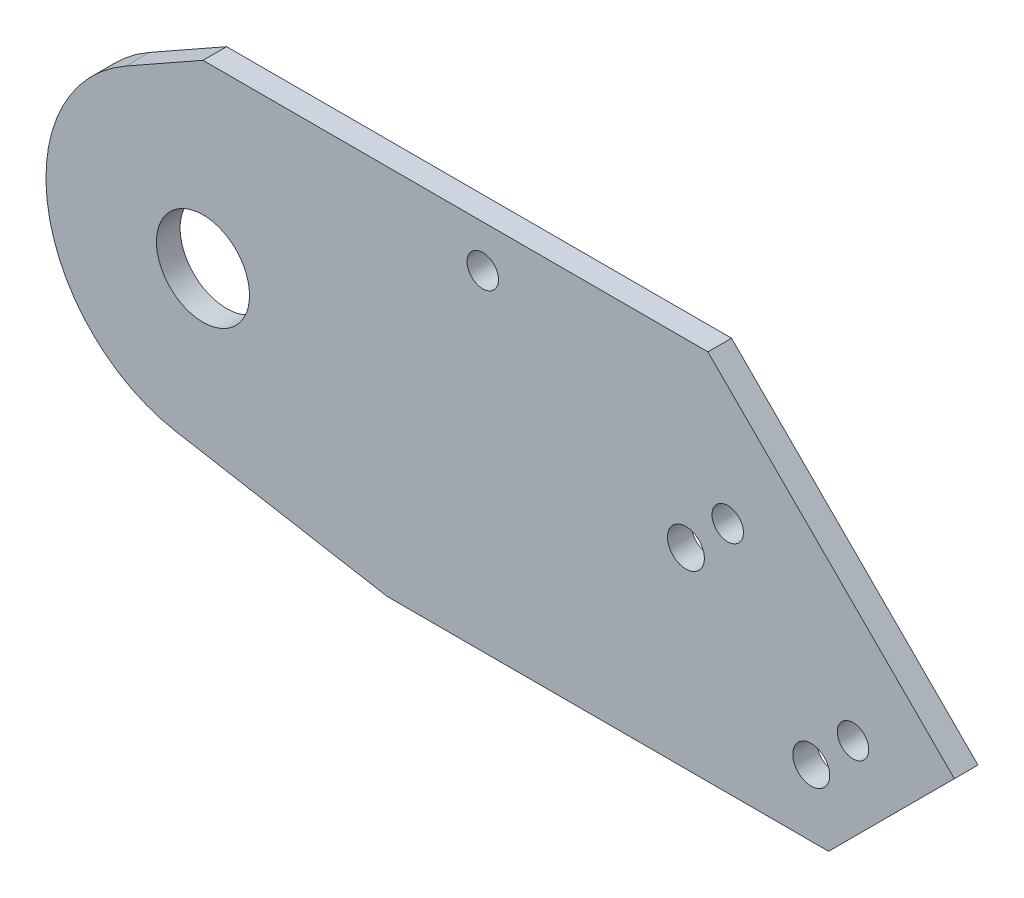
ISO-10303-21;
HEADER;
FILE_DESCRIPTION(('STEP AP214'),'2;1');
FILE_NAME('part.step','',(''),(''),'','','');
FILE_SCHEMA(('AUTOMOTIVE_DESIGN { 1 0 10303 214 1 1 1 1 }'));
ENDSEC;
DATA;
#1=APPLICATION_CONTEXT('core data for automotive mechanical design processes');
#2=APPLICATION_PROTOCOL_DEFINITION('international standard','automotive_design',2000,#1);
#3=PRODUCT_CONTEXT('',#1,'mechanical');
#4=PRODUCT('Part','Part','',(#3));
#5=PRODUCT_RELATED_PRODUCT_CATEGORY('part','',(#4));
#6=PRODUCT_DEFINITION_FORMATION('','',#4);
#7=PRODUCT_DEFINITION_CONTEXT('part definition',#1,'design');
#8=PRODUCT_DEFINITION('design','',#6,#7);
#9=PRODUCT_DEFINITION_SHAPE('','',#8);
#10=(LENGTH_UNIT() NAMED_UNIT(*) SI_UNIT(.MILLI.,.METRE.));
#11=(NAMED_UNIT(*) PLANE_ANGLE_UNIT() SI_UNIT($,.RADIAN.));
#12=(NAMED_UNIT(*) SI_UNIT($,.STERADIAN.) SOLID_ANGLE_UNIT());
#13=UNCERTAINTY_MEASURE_WITH_UNIT(LENGTH_MEASURE(1.E-05),#10,'distance_accuracy_value','');
#14=(GEOMETRIC_REPRESENTATION_CONTEXT(3) GLOBAL_UNCERTAINTY_ASSIGNED_CONTEXT((#13)) GLOBAL_UNIT_ASSIGNED_CONTEXT((#10,
#11,#12)) REPRESENTATION_CONTEXT('',''));
#15=CARTESIAN_POINT('',(0.,0.,0.));
#16=DIRECTION('',(0.,0.,1.));
#17=DIRECTION('',(1.,0.,0.));
#18=AXIS2_PLACEMENT_3D('',#15,#16,#17);
#19=CARTESIAN_POINT('',(0.,0.,2.032));
#20=DIRECTION('',(0.,0.,1.));
#21=DIRECTION('',(1.,0.,0.));
#22=AXIS2_PLACEMENT_3D('',#19,#20,#21);
#23=PLANE('',#22);
#24=CARTESIAN_POINT('',(55.8833357109557,-7.21452782203279,2.032));
#25=DIRECTION('',(0.,0.,-1.));
#26=DIRECTION('',(-1.,0.,0.));
#27=AXIS2_PLACEMENT_3D('',#24,#25,#26);
#28=CIRCLE('',#27,1.35254999999999);
#29=CARTESIAN_POINT('',(54.5307857109557,-7.21452782203279,2.032));
#30=VERTEX_POINT('',#29);
#31=EDGE_CURVE('E190',#30,#30,#28,.T.);
#32=ORIENTED_EDGE('',*,*,#31,.T.);
#33=EDGE_LOOP('',(#32));
#34=FACE_BOUND('',#33,.T.);
#35=CARTESIAN_POINT('',(45.1070283656727,3.5617795232502,2.032));
#36=DIRECTION('',(0.,0.,-1.));
#37=DIRECTION('',(-1.,0.,0.));
#38=AXIS2_PLACEMENT_3D('',#35,#36,#37);
#39=CIRCLE('',#38,1.35254999999999);
#40=CARTESIAN_POINT('',(43.7544783656727,3.5617795232502,2.032));
#41=VERTEX_POINT('',#40);
#42=EDGE_CURVE('E184',#41,#41,#39,.T.);
#43=ORIENTED_EDGE('',*,*,#42,.T.);
#44=EDGE_LOOP('',(#43));
#45=FACE_BOUND('',#44,.T.);
#46=CARTESIAN_POINT('',(52.291233262528,-10.8066302704605,2.032));
#47=DIRECTION('',(0.,0.,-1.));
#48=DIRECTION('',(-1.,0.,0.));
#49=AXIS2_PLACEMENT_3D('',#46,#47,#48);
#50=CIRCLE('',#49,1.5875);
#51=CARTESIAN_POINT('',(50.703733262528,-10.8066302704605,2.032));
#52=VERTEX_POINT('',#51);
#53=EDGE_CURVE('E178',#52,#52,#50,.T.);
#54=ORIENTED_EDGE('',*,*,#53,.T.);
#55=EDGE_LOOP('',(#54));
#56=FACE_BOUND('',#55,.T.);
#57=CARTESIAN_POINT('',(41.514925917245,-0.0303229251774617,2.032));
#58=DIRECTION('',(0.,0.,-1.));
#59=DIRECTION('',(-1.,0.,0.));
#60=AXIS2_PLACEMENT_3D('',#57,#58,#59);
#61=CIRCLE('',#60,1.5875);
#62=CARTESIAN_POINT('',(39.927425917245,-0.0303229251774617,2.032));
#63=VERTEX_POINT('',#62);
#64=EDGE_CURVE('E172',#63,#63,#61,.T.);
#65=ORIENTED_EDGE('',*,*,#64,.T.);
#66=EDGE_LOOP('',(#65));
#67=FACE_BOUND('',#66,.T.);
#68=CARTESIAN_POINT('',(0.,0.,2.032));
#69=DIRECTION('',(0.,0.,1.));
#70=DIRECTION('',(1.,0.,0.));
#71=AXIS2_PLACEMENT_3D('',#68,#69,#70);
#72=CIRCLE('',#71,4.);
#73=CARTESIAN_POINT('',(4.,0.,2.032));
#74=VERTEX_POINT('',#73);
#75=EDGE_CURVE('E130',#74,#74,#72,.T.);
#76=ORIENTED_EDGE('',*,*,#75,.F.);
#77=EDGE_LOOP('',(#76));
#78=FACE_BOUND('',#77,.T.);
#79=DIRECTION('',(0.707106781186547,0.707106781186548,0.));
#80=VECTOR('',#79,1.);
#81=CARTESIAN_POINT('',(64.5941841483928,-5.68788428145106,2.032));
#82=LINE('',#81,#80);
#83=CARTESIAN_POINT('',(53.7820684298438,-16.5,2.032));
#84=VERTEX_POINT('',#83);
#85=CARTESIAN_POINT('',(64.5941841483928,-5.68788428145106,2.032));
#86=VERTEX_POINT('',#85);
#87=EDGE_CURVE('E139',#84,#86,#82,.T.);
#88=ORIENTED_EDGE('',*,*,#87,.T.);
#89=DIRECTION('',(-0.707106781186548,0.707106781186548,0.));
#90=VECTOR('',#89,1.);
#91=CARTESIAN_POINT('',(64.5941841483928,-5.68788428145106,2.032));
#92=LINE('',#91,#90);
#93=CARTESIAN_POINT('',(43.4062998669417,15.5,2.032));
#94=VERTEX_POINT('',#93);
#95=EDGE_CURVE('E92',#86,#94,#92,.T.);
#96=ORIENTED_EDGE('',*,*,#95,.T.);
#97=DIRECTION('',(-1.,0.,0.));
#98=VECTOR('',#97,1.);
#99=CARTESIAN_POINT('',(0.,15.5,2.032));
#100=LINE('',#99,#98);
#101=CARTESIAN_POINT('',(0.,15.5,2.032));
#102=VERTEX_POINT('',#101);
#103=EDGE_CURVE('E151',#94,#102,#100,.T.);
#104=ORIENTED_EDGE('',*,*,#103,.T.);
#105=DIRECTION('',(-0.870967741935482,-0.49134020037832,0.));
#106=VECTOR('',#105,1.);
#107=CARTESIAN_POINT('',(-6.63309270510731,11.758064516129,2.032));
#108=LINE('',#107,#106);
#109=CARTESIAN_POINT('',(-6.63309270510731,11.758064516129,2.032));
#110=VERTEX_POINT('',#109);
#111=EDGE_CURVE('E108',#102,#110,#108,.T.);
#112=ORIENTED_EDGE('',*,*,#111,.T.);
#113=CARTESIAN_POINT('',(0.,0.,2.032));
#114=DIRECTION('',(0.,0.,1.));
#115=DIRECTION('',(1.,0.,0.));
#116=AXIS2_PLACEMENT_3D('',#113,#114,#115);
#117=CIRCLE('',#116,13.5);
#118=CARTESIAN_POINT('',(-2.34425039850357,-13.2949046656648,2.032));
#119=VERTEX_POINT('',#118);
#120=EDGE_CURVE('E102',#110,#119,#117,.T.);
#121=ORIENTED_EDGE('',*,*,#120,.T.);
#122=DIRECTION('',(0.984807753012208,-0.173648177666931,0.));
#123=VECTOR('',#122,1.);
#124=CARTESIAN_POINT('',(-2.34425039850357,-13.2949046656648,2.032));
#125=LINE('',#124,#123);
#126=CARTESIAN_POINT('',(15.8327485012531,-16.5,2.032));
#127=VERTEX_POINT('',#126);
#128=EDGE_CURVE('E106',#119,#127,#125,.T.);
#129=ORIENTED_EDGE('',*,*,#128,.T.);
#130=DIRECTION('',(1.,0.,0.));
#131=VECTOR('',#130,1.);
#132=CARTESIAN_POINT('',(15.8327485012531,-16.5,2.032));
#133=LINE('',#132,#131);
#134=EDGE_CURVE('E52',#127,#84,#133,.T.);
#135=ORIENTED_EDGE('',*,*,#134,.T.);
#136=EDGE_LOOP('',(#88,#96,#104,#112,#121,#129,#135));
#137=FACE_BOUND('',#136,.T.);
#138=CARTESIAN_POINT('',(24.0532446160567,11.8675875071896,2.032));
#139=DIRECTION('',(0.,0.,1.));
#140=DIRECTION('',(1.,0.,0.));
#141=AXIS2_PLACEMENT_3D('',#138,#139,#140);
#142=CIRCLE('',#141,1.35255);
#143=CARTESIAN_POINT('',(25.4057946160567,11.8675875071896,2.032));
#144=VERTEX_POINT('',#143);
#145=EDGE_CURVE('E166',#144,#144,#142,.T.);
#146=ORIENTED_EDGE('',*,*,#145,.F.);
#147=EDGE_LOOP('',(#146));
#148=FACE_BOUND('',#147,.T.);
#149=ADVANCED_FACE('F35',(#34,#45,#56,#67,#78,#137,#148),#23,.T.);
#150=CARTESIAN_POINT('',(0.,0.,0.));
#151=DIRECTION('',(0.,0.,1.));
#152=DIRECTION('',(1.,0.,0.));
#153=AXIS2_PLACEMENT_3D('',#150,#151,#152);
#154=PLANE('',#153);
#155=CARTESIAN_POINT('',(55.8833357109557,-7.21452782203279,0.));
#156=DIRECTION('',(0.,0.,-1.));
#157=DIRECTION('',(-1.,0.,0.));
#158=AXIS2_PLACEMENT_3D('',#155,#156,#157);
#159=CIRCLE('',#158,1.35254999999999);
#160=CARTESIAN_POINT('',(54.5307857109557,-7.21452782203279,0.));
#161=VERTEX_POINT('',#160);
#162=EDGE_CURVE('E193',#161,#161,#159,.T.);
#163=ORIENTED_EDGE('',*,*,#162,.F.);
#164=EDGE_LOOP('',(#163));
#165=FACE_BOUND('',#164,.T.);
#166=CARTESIAN_POINT('',(45.1070283656727,3.5617795232502,0.));
#167=DIRECTION('',(0.,0.,-1.));
#168=DIRECTION('',(-1.,0.,0.));
#169=AXIS2_PLACEMENT_3D('',#166,#167,#168);
#170=CIRCLE('',#169,1.35254999999999);
#171=CARTESIAN_POINT('',(43.7544783656727,3.5617795232502,0.));
#172=VERTEX_POINT('',#171);
#173=EDGE_CURVE('E187',#172,#172,#170,.T.);
#174=ORIENTED_EDGE('',*,*,#173,.F.);
#175=EDGE_LOOP('',(#174));
#176=FACE_BOUND('',#175,.T.);
#177=CARTESIAN_POINT('',(52.291233262528,-10.8066302704605,0.));
#178=DIRECTION('',(0.,0.,-1.));
#179=DIRECTION('',(-1.,0.,0.));
#180=AXIS2_PLACEMENT_3D('',#177,#178,#179);
#181=CIRCLE('',#180,1.5875);
#182=CARTESIAN_POINT('',(50.703733262528,-10.8066302704605,0.));
#183=VERTEX_POINT('',#182);
#184=EDGE_CURVE('E181',#183,#183,#181,.T.);
#185=ORIENTED_EDGE('',*,*,#184,.F.);
#186=EDGE_LOOP('',(#185));
#187=FACE_BOUND('',#186,.T.);
#188=CARTESIAN_POINT('',(41.514925917245,-0.0303229251774617,0.));
#189=DIRECTION('',(0.,0.,-1.));
#190=DIRECTION('',(-1.,0.,0.));
#191=AXIS2_PLACEMENT_3D('',#188,#189,#190);
#192=CIRCLE('',#191,1.5875);
#193=CARTESIAN_POINT('',(39.927425917245,-0.0303229251774617,0.));
#194=VERTEX_POINT('',#193);
#195=EDGE_CURVE('E175',#194,#194,#192,.T.);
#196=ORIENTED_EDGE('',*,*,#195,.F.);
#197=EDGE_LOOP('',(#196));
#198=FACE_BOUND('',#197,.T.);
#199=DIRECTION('',(0.707106781186547,0.707106781186548,0.));
#200=VECTOR('',#199,1.);
#201=CARTESIAN_POINT('',(64.5941841483928,-5.68788428145106,0.));
#202=LINE('',#201,#200);
#203=CARTESIAN_POINT('',(53.7820684298438,-16.5,0.));
#204=VERTEX_POINT('',#203);
#205=CARTESIAN_POINT('',(64.5941841483928,-5.68788428145106,0.));
#206=VERTEX_POINT('',#205);
#207=EDGE_CURVE('E126',#204,#206,#202,.T.);
#208=ORIENTED_EDGE('',*,*,#207,.F.);
#209=DIRECTION('',(1.,0.,0.));
#210=VECTOR('',#209,1.);
#211=CARTESIAN_POINT('',(15.8327485012531,-16.5,0.));
#212=LINE('',#211,#210);
#213=CARTESIAN_POINT('',(15.8327485012531,-16.5,0.));
#214=VERTEX_POINT('',#213);
#215=EDGE_CURVE('E84',#214,#204,#212,.T.);
#216=ORIENTED_EDGE('',*,*,#215,.F.);
#217=DIRECTION('',(0.984807753012208,-0.173648177666931,0.));
#218=VECTOR('',#217,1.);
#219=CARTESIAN_POINT('',(-2.34425039850357,-13.2949046656648,0.));
#220=LINE('',#219,#218);
#221=CARTESIAN_POINT('',(-2.34425039850357,-13.2949046656648,0.));
#222=VERTEX_POINT('',#221);
#223=EDGE_CURVE('E78',#222,#214,#220,.T.);
#224=ORIENTED_EDGE('',*,*,#223,.F.);
#225=CARTESIAN_POINT('',(0.,0.,0.));
#226=DIRECTION('',(0.,0.,1.));
#227=DIRECTION('',(1.,0.,0.));
#228=AXIS2_PLACEMENT_3D('',#225,#226,#227);
#229=CIRCLE('',#228,13.5);
#230=CARTESIAN_POINT('',(-6.63309270510731,11.758064516129,0.));
#231=VERTEX_POINT('',#230);
#232=EDGE_CURVE('E116',#231,#222,#229,.T.);
#233=ORIENTED_EDGE('',*,*,#232,.F.);
#234=DIRECTION('',(-0.870967741935482,-0.49134020037832,0.));
#235=VECTOR('',#234,1.);
#236=CARTESIAN_POINT('',(-6.63309270510731,11.758064516129,0.));
#237=LINE('',#236,#235);
#238=CARTESIAN_POINT('',(0.,15.5,0.));
#239=VERTEX_POINT('',#238);
#240=EDGE_CURVE('E134',#239,#231,#237,.T.);
#241=ORIENTED_EDGE('',*,*,#240,.F.);
#242=DIRECTION('',(-1.,0.,0.));
#243=VECTOR('',#242,1.);
#244=CARTESIAN_POINT('',(0.,15.5,0.));
#245=LINE('',#244,#243);
#246=CARTESIAN_POINT('',(43.4062998669417,15.5,0.));
#247=VERTEX_POINT('',#246);
#248=EDGE_CURVE('E132',#247,#239,#245,.T.);
#249=ORIENTED_EDGE('',*,*,#248,.F.);
#250=DIRECTION('',(-0.707106781186548,0.707106781186548,0.));
#251=VECTOR('',#250,1.);
#252=CARTESIAN_POINT('',(64.5941841483928,-5.68788428145106,0.));
#253=LINE('',#252,#251);
#254=EDGE_CURVE('E129',#206,#247,#253,.T.);
#255=ORIENTED_EDGE('',*,*,#254,.F.);
#256=EDGE_LOOP('',(#208,#216,#224,#233,#241,#249,#255));
#257=FACE_BOUND('',#256,.T.);
#258=CARTESIAN_POINT('',(0.,0.,0.));
#259=DIRECTION('',(0.,0.,1.));
#260=DIRECTION('',(1.,0.,0.));
#261=AXIS2_PLACEMENT_3D('',#258,#259,#260);
#262=CIRCLE('',#261,4.);
#263=CARTESIAN_POINT('',(4.,0.,0.));
#264=VERTEX_POINT('',#263);
#265=EDGE_CURVE('E163',#264,#264,#262,.T.);
#266=ORIENTED_EDGE('',*,*,#265,.T.);
#267=EDGE_LOOP('',(#266));
#268=FACE_BOUND('',#267,.T.);
#269=CARTESIAN_POINT('',(24.0532446160567,11.8675875071896,0.));
#270=DIRECTION('',(0.,0.,1.));
#271=DIRECTION('',(1.,0.,0.));
#272=AXIS2_PLACEMENT_3D('',#269,#270,#271);
#273=CIRCLE('',#272,1.35255);
#274=CARTESIAN_POINT('',(25.4057946160567,11.8675875071896,0.));
#275=VERTEX_POINT('',#274);
#276=EDGE_CURVE('E169',#275,#275,#273,.T.);
#277=ORIENTED_EDGE('',*,*,#276,.T.);
#278=EDGE_LOOP('',(#277));
#279=FACE_BOUND('',#278,.T.);
#280=ADVANCED_FACE('F155',(#165,#176,#187,#198,#257,#268,#279),#154,.F.);
#281=CARTESIAN_POINT('',(64.5941841483928,-5.68788428145106,2.032));
#282=DIRECTION('',(-0.707106781186548,0.707106781186547,0.));
#283=DIRECTION('',(-0.707106781186547,-0.707106781186548,0.));
#284=AXIS2_PLACEMENT_3D('',#281,#282,#283);
#285=PLANE('',#284);
#286=ORIENTED_EDGE('',*,*,#207,.T.);
#287=DIRECTION('',(0.,0.,-1.));
#288=VECTOR('',#287,1.);
#289=CARTESIAN_POINT('',(64.5941841483928,-5.68788428145106,2.032));
#290=LINE('',#289,#288);
#291=EDGE_CURVE('E11',#86,#206,#290,.T.);
#292=ORIENTED_EDGE('',*,*,#291,.F.);
#293=ORIENTED_EDGE('',*,*,#87,.F.);
#294=DIRECTION('',(0.,0.,-1.));
#295=VECTOR('',#294,1.);
#296=CARTESIAN_POINT('',(53.7820684298438,-16.5,2.032));
#297=LINE('',#296,#295);
#298=EDGE_CURVE('E122',#84,#204,#297,.T.);
#299=ORIENTED_EDGE('',*,*,#298,.T.);
#300=EDGE_LOOP('',(#286,#292,#293,#299));
#301=FACE_BOUND('',#300,.T.);
#302=ADVANCED_FACE('F37',(#301),#285,.F.);
#303=CARTESIAN_POINT('',(64.5941841483928,-5.68788428145106,2.032));
#304=DIRECTION('',(-0.707106781186548,-0.707106781186548,0.));
#305=DIRECTION('',(0.707106781186548,-0.707106781186548,0.));
#306=AXIS2_PLACEMENT_3D('',#303,#304,#305);
#307=PLANE('',#306);
#308=ORIENTED_EDGE('',*,*,#254,.T.);
#309=DIRECTION('',(0.,0.,-1.));
#310=VECTOR('',#309,1.);
#311=CARTESIAN_POINT('',(43.4062998669417,15.5,2.032));
#312=LINE('',#311,#310);
#313=EDGE_CURVE('E44',#94,#247,#312,.T.);
#314=ORIENTED_EDGE('',*,*,#313,.F.);
#315=ORIENTED_EDGE('',*,*,#95,.F.);
#316=ORIENTED_EDGE('',*,*,#291,.T.);
#317=EDGE_LOOP('',(#308,#314,#315,#316));
#318=FACE_BOUND('',#317,.T.);
#319=ADVANCED_FACE('F249',(#318),#307,.F.);
#320=CARTESIAN_POINT('',(0.,15.5,2.032));
#321=DIRECTION('',(0.,-1.,0.));
#322=DIRECTION('',(0.,0.,-1.));
#323=AXIS2_PLACEMENT_3D('',#320,#321,#322);
#324=PLANE('',#323);
#325=ORIENTED_EDGE('',*,*,#248,.T.);
#326=DIRECTION('',(0.,0.,-1.));
#327=VECTOR('',#326,1.);
#328=CARTESIAN_POINT('',(0.,15.5,2.032));
#329=LINE('',#328,#327);
#330=EDGE_CURVE('E143',#102,#239,#329,.T.);
#331=ORIENTED_EDGE('',*,*,#330,.F.);
#332=ORIENTED_EDGE('',*,*,#103,.F.);
#333=ORIENTED_EDGE('',*,*,#313,.T.);
#334=EDGE_LOOP('',(#325,#331,#332,#333));
#335=FACE_BOUND('',#334,.T.);
#336=ADVANCED_FACE('F149',(#335),#324,.F.);
#337=CARTESIAN_POINT('',(-6.63309270510731,11.758064516129,2.032));
#338=DIRECTION('',(0.49134020037832,-0.870967741935482,0.));
#339=DIRECTION('',(0.870967741935482,0.49134020037832,0.));
#340=AXIS2_PLACEMENT_3D('',#337,#338,#339);
#341=PLANE('',#340);
#342=ORIENTED_EDGE('',*,*,#240,.T.);
#343=DIRECTION('',(0.,0.,-1.));
#344=VECTOR('',#343,1.);
#345=CARTESIAN_POINT('',(-6.63309270510731,11.758064516129,2.032));
#346=LINE('',#345,#344);
#347=EDGE_CURVE('E117',#110,#231,#346,.T.);
#348=ORIENTED_EDGE('',*,*,#347,.F.);
#349=ORIENTED_EDGE('',*,*,#111,.F.);
#350=ORIENTED_EDGE('',*,*,#330,.T.);
#351=EDGE_LOOP('',(#342,#348,#349,#350));
#352=FACE_BOUND('',#351,.T.);
#353=ADVANCED_FACE('F158',(#352),#341,.F.);
#354=CARTESIAN_POINT('',(0.,0.,2.032));
#355=DIRECTION('',(0.,0.,-1.));
#356=DIRECTION('',(-1.,0.,0.));
#357=AXIS2_PLACEMENT_3D('',#354,#355,#356);
#358=CYLINDRICAL_SURFACE('',#357,13.5);
#359=ORIENTED_EDGE('',*,*,#232,.T.);
#360=DIRECTION('',(0.,0.,-1.));
#361=VECTOR('',#360,1.);
#362=CARTESIAN_POINT('',(-2.34425039850357,-13.2949046656648,2.032));
#363=LINE('',#362,#361);
#364=EDGE_CURVE('E113',#119,#222,#363,.T.);
#365=ORIENTED_EDGE('',*,*,#364,.F.);
#366=ORIENTED_EDGE('',*,*,#120,.F.);
#367=ORIENTED_EDGE('',*,*,#347,.T.);
#368=EDGE_LOOP('',(#359,#365,#366,#367));
#369=FACE_BOUND('',#368,.T.);
#370=ADVANCED_FACE('F114',(#369),#358,.T.);
#371=CARTESIAN_POINT('',(-2.34425039850357,-13.2949046656648,2.032));
#372=DIRECTION('',(0.173648177666931,0.984807753012208,0.));
#373=DIRECTION('',(-0.984807753012208,0.173648177666931,0.));
#374=AXIS2_PLACEMENT_3D('',#371,#372,#373);
#375=PLANE('',#374);
#376=ORIENTED_EDGE('',*,*,#223,.T.);
#377=DIRECTION('',(0.,0.,-1.));
#378=VECTOR('',#377,1.);
#379=CARTESIAN_POINT('',(15.8327485012531,-16.5,2.032));
#380=LINE('',#379,#378);
#381=EDGE_CURVE('E118',#127,#214,#380,.T.);
#382=ORIENTED_EDGE('',*,*,#381,.F.);
#383=ORIENTED_EDGE('',*,*,#128,.F.);
#384=ORIENTED_EDGE('',*,*,#364,.T.);
#385=EDGE_LOOP('',(#376,#382,#383,#384));
#386=FACE_BOUND('',#385,.T.);
#387=ADVANCED_FACE('F120',(#386),#375,.F.);
#388=CARTESIAN_POINT('',(15.8327485012531,-16.5,2.032));
#389=DIRECTION('',(0.,1.,0.));
#390=DIRECTION('',(-1.,0.,0.));
#391=AXIS2_PLACEMENT_3D('',#388,#389,#390);
#392=PLANE('',#391);
#393=ORIENTED_EDGE('',*,*,#215,.T.);
#394=ORIENTED_EDGE('',*,*,#298,.F.);
#395=ORIENTED_EDGE('',*,*,#134,.F.);
#396=ORIENTED_EDGE('',*,*,#381,.T.);
#397=EDGE_LOOP('',(#393,#394,#395,#396));
#398=FACE_BOUND('',#397,.T.);
#399=ADVANCED_FACE('F239',(#398),#392,.F.);
#400=CARTESIAN_POINT('',(0.,0.,2.032));
#401=DIRECTION('',(0.,0.,-1.));
#402=DIRECTION('',(-1.,0.,0.));
#403=AXIS2_PLACEMENT_3D('',#400,#401,#402);
#404=CYLINDRICAL_SURFACE('',#403,4.);
#405=ORIENTED_EDGE('',*,*,#75,.T.);
#406=EDGE_LOOP('',(#405));
#407=FACE_BOUND('',#406,.T.);
#408=ORIENTED_EDGE('',*,*,#265,.F.);
#409=EDGE_LOOP('',(#408));
#410=FACE_BOUND('',#409,.T.);
#411=ADVANCED_FACE('F229',(#407,#410),#404,.F.);
#412=CARTESIAN_POINT('',(24.0532446160567,11.8675875071896,2.032));
#413=DIRECTION('',(0.,0.,-1.));
#414=DIRECTION('',(-1.,0.,0.));
#415=AXIS2_PLACEMENT_3D('',#412,#413,#414);
#416=CYLINDRICAL_SURFACE('',#415,1.35255);
#417=ORIENTED_EDGE('',*,*,#145,.T.);
#418=EDGE_LOOP('',(#417));
#419=FACE_BOUND('',#418,.T.);
#420=ORIENTED_EDGE('',*,*,#276,.F.);
#421=EDGE_LOOP('',(#420));
#422=FACE_BOUND('',#421,.T.);
#423=ADVANCED_FACE('F220',(#419,#422),#416,.F.);
#424=CARTESIAN_POINT('',(41.514925917245,-0.0303229251774617,2.032));
#425=DIRECTION('',(0.,0.,-1.));
#426=DIRECTION('',(-1.,0.,0.));
#427=AXIS2_PLACEMENT_3D('',#424,#425,#426);
#428=CYLINDRICAL_SURFACE('',#427,1.5875);
#429=ORIENTED_EDGE('',*,*,#64,.F.);
#430=EDGE_LOOP('',(#429));
#431=FACE_BOUND('',#430,.T.);
#432=ORIENTED_EDGE('',*,*,#195,.T.);
#433=EDGE_LOOP('',(#432));
#434=FACE_BOUND('',#433,.T.);
#435=ADVANCED_FACE('F217',(#431,#434),#428,.F.);
#436=CARTESIAN_POINT('',(52.291233262528,-10.8066302704605,2.032));
#437=DIRECTION('',(0.,0.,-1.));
#438=DIRECTION('',(-1.,0.,0.));
#439=AXIS2_PLACEMENT_3D('',#436,#437,#438);
#440=CYLINDRICAL_SURFACE('',#439,1.5875);
#441=ORIENTED_EDGE('',*,*,#53,.F.);
#442=EDGE_LOOP('',(#441));
#443=FACE_BOUND('',#442,.T.);
#444=ORIENTED_EDGE('',*,*,#184,.T.);
#445=EDGE_LOOP('',(#444));
#446=FACE_BOUND('',#445,.T.);
#447=ADVANCED_FACE('F219',(#443,#446),#440,.F.);
#448=CARTESIAN_POINT('',(45.1070283656727,3.5617795232502,2.032));
#449=DIRECTION('',(0.,0.,-1.));
#450=DIRECTION('',(-1.,0.,0.));
#451=AXIS2_PLACEMENT_3D('',#448,#449,#450);
#452=CYLINDRICAL_SURFACE('',#451,1.35254999999999);
#453=ORIENTED_EDGE('',*,*,#42,.F.);
#454=EDGE_LOOP('',(#453));
#455=FACE_BOUND('',#454,.T.);
#456=ORIENTED_EDGE('',*,*,#173,.T.);
#457=EDGE_LOOP('',(#456));
#458=FACE_BOUND('',#457,.T.);
#459=ADVANCED_FACE('F204',(#455,#458),#452,.F.);
#460=CARTESIAN_POINT('',(55.8833357109557,-7.21452782203279,2.032));
#461=DIRECTION('',(0.,0.,-1.));
#462=DIRECTION('',(-1.,0.,0.));
#463=AXIS2_PLACEMENT_3D('',#460,#461,#462);
#464=CYLINDRICAL_SURFACE('',#463,1.35254999999999);
#465=ORIENTED_EDGE('',*,*,#31,.F.);
#466=EDGE_LOOP('',(#465));
#467=FACE_BOUND('',#466,.T.);
#468=ORIENTED_EDGE('',*,*,#162,.T.);
#469=EDGE_LOOP('',(#468));
#470=FACE_BOUND('',#469,.T.);
#471=ADVANCED_FACE('F201',(#467,#470),#464,.F.);
#472=CLOSED_SHELL('',(#149,#280,#302,#319,#336,#353,#370,#387,#399,#411,#423,#435,#447,#459,#471));
#473=MANIFOLD_SOLID_BREP('B2',#472);
#474=ADVANCED_BREP_SHAPE_REPRESENTATION('',(#18,#473),#14);
#475=SHAPE_DEFINITION_REPRESENTATION(#9,#474);
ENDSEC;
END-ISO-10303-21;
